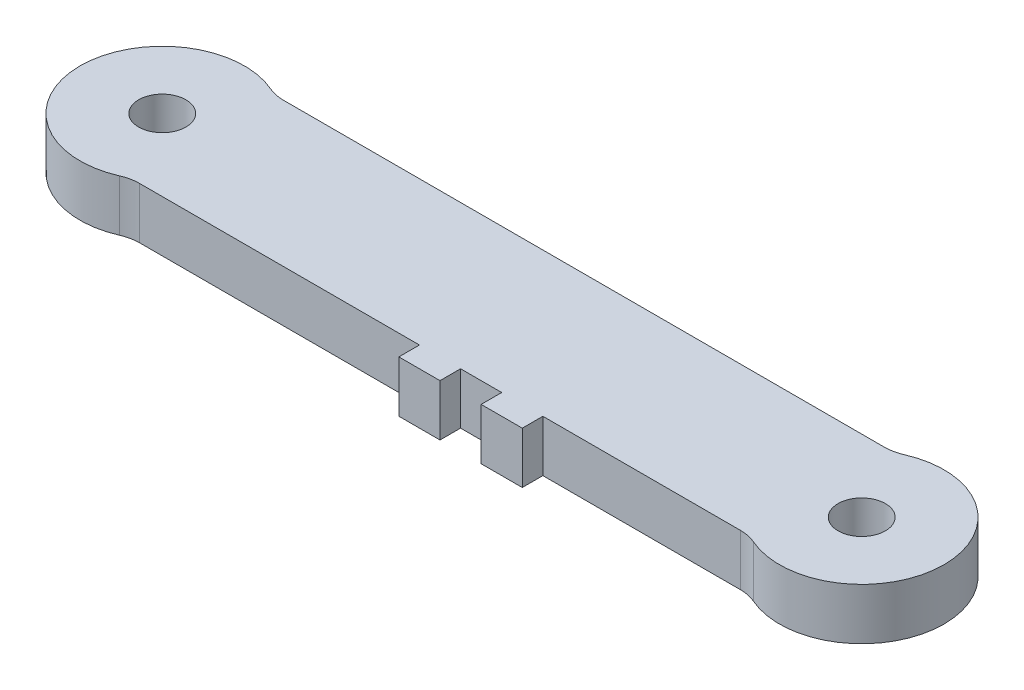
ISO-10303-21;
HEADER;
FILE_DESCRIPTION(('STEP AP214'),'2;1');
FILE_NAME('part.step','',(''),(''),'','','');
FILE_SCHEMA(('AUTOMOTIVE_DESIGN { 1 0 10303 214 1 1 1 1 }'));
ENDSEC;
DATA;
#1=APPLICATION_CONTEXT('core data for automotive mechanical design processes');
#2=APPLICATION_PROTOCOL_DEFINITION('international standard','automotive_design',2000,#1);
#3=PRODUCT_CONTEXT('',#1,'mechanical');
#4=PRODUCT('Part','Part','',(#3));
#5=PRODUCT_RELATED_PRODUCT_CATEGORY('part','',(#4));
#6=PRODUCT_DEFINITION_FORMATION('','',#4);
#7=PRODUCT_DEFINITION_CONTEXT('part definition',#1,'design');
#8=PRODUCT_DEFINITION('design','',#6,#7);
#9=PRODUCT_DEFINITION_SHAPE('','',#8);
#10=(LENGTH_UNIT() NAMED_UNIT(*) SI_UNIT(.MILLI.,.METRE.));
#11=(NAMED_UNIT(*) PLANE_ANGLE_UNIT() SI_UNIT($,.RADIAN.));
#12=(NAMED_UNIT(*) SI_UNIT($,.STERADIAN.) SOLID_ANGLE_UNIT());
#13=UNCERTAINTY_MEASURE_WITH_UNIT(LENGTH_MEASURE(1.E-05),#10,'distance_accuracy_value','');
#14=(GEOMETRIC_REPRESENTATION_CONTEXT(3) GLOBAL_UNCERTAINTY_ASSIGNED_CONTEXT((#13)) GLOBAL_UNIT_ASSIGNED_CONTEXT((#10,
#11,#12)) REPRESENTATION_CONTEXT('',''));
#15=CARTESIAN_POINT('',(0.,0.,0.));
#16=DIRECTION('',(0.,0.,1.));
#17=DIRECTION('',(1.,0.,0.));
#18=AXIS2_PLACEMENT_3D('',#15,#16,#17);
#19=CARTESIAN_POINT('',(0.,3.175,4.445));
#20=DIRECTION('',(0.,0.,-1.));
#21=DIRECTION('',(-1.,0.,0.));
#22=AXIS2_PLACEMENT_3D('',#19,#20,#21);
#23=PLANE('',#22);
#24=DIRECTION('',(0.,-1.,0.));
#25=VECTOR('',#24,1.);
#26=CARTESIAN_POINT('',(20.32,3.175,4.445));
#27=LINE('',#26,#25);
#28=CARTESIAN_POINT('',(20.32,3.175,4.445));
#29=VERTEX_POINT('',#28);
#30=CARTESIAN_POINT('',(20.32,0.,4.445));
#31=VERTEX_POINT('',#30);
#32=EDGE_CURVE('E58',#29,#31,#27,.T.);
#33=ORIENTED_EDGE('',*,*,#32,.F.);
#34=DIRECTION('',(1.,0.,0.));
#35=VECTOR('',#34,1.);
#36=CARTESIAN_POINT('',(0.,3.175,4.445));
#37=LINE('',#36,#35);
#38=CARTESIAN_POINT('',(3.04535301730358,3.175,4.445));
#39=VERTEX_POINT('',#38);
#40=EDGE_CURVE('E215',#39,#29,#37,.T.);
#41=ORIENTED_EDGE('',*,*,#40,.F.);
#42=DIRECTION('',(0.,1.,0.));
#43=VECTOR('',#42,1.);
#44=CARTESIAN_POINT('',(3.04535301730358,0.,4.445));
#45=LINE('',#44,#43);
#46=CARTESIAN_POINT('',(3.04535301730358,0.,4.445));
#47=VERTEX_POINT('',#46);
#48=EDGE_CURVE('E246',#39,#47,#45,.F.);
#49=ORIENTED_EDGE('',*,*,#48,.T.);
#50=DIRECTION('',(1.,0.,0.));
#51=VECTOR('',#50,1.);
#52=CARTESIAN_POINT('',(0.,0.,4.445));
#53=LINE('',#52,#51);
#54=EDGE_CURVE('E233',#47,#31,#53,.T.);
#55=ORIENTED_EDGE('',*,*,#54,.T.);
#56=EDGE_LOOP('',(#33,#41,#49,#55));
#57=FACE_BOUND('',#56,.T.);
#58=ADVANCED_FACE('F35',(#57),#23,.F.);
#59=DIRECTION('',(0.,1.,0.));
#60=VECTOR('',#59,1.);
#61=CARTESIAN_POINT('',(22.86,3.175,4.445));
#62=LINE('',#61,#60);
#63=CARTESIAN_POINT('',(22.86,0.,4.445));
#64=VERTEX_POINT('',#63);
#65=CARTESIAN_POINT('',(22.86,3.175,4.445));
#66=VERTEX_POINT('',#65);
#67=EDGE_CURVE('E171',#64,#66,#62,.T.);
#68=ORIENTED_EDGE('',*,*,#67,.F.);
#69=CARTESIAN_POINT('',(25.4,0.,4.445));
#70=VERTEX_POINT('',#69);
#71=EDGE_CURVE('E236',#64,#70,#53,.T.);
#72=ORIENTED_EDGE('',*,*,#71,.T.);
#73=DIRECTION('',(0.,-1.,0.));
#74=VECTOR('',#73,1.);
#75=CARTESIAN_POINT('',(25.4,3.175,4.445));
#76=LINE('',#75,#74);
#77=CARTESIAN_POINT('',(25.4,3.175,4.445));
#78=VERTEX_POINT('',#77);
#79=EDGE_CURVE('E174',#78,#70,#76,.T.);
#80=ORIENTED_EDGE('',*,*,#79,.F.);
#81=EDGE_CURVE('E50',#66,#78,#37,.T.);
#82=ORIENTED_EDGE('',*,*,#81,.F.);
#83=EDGE_LOOP('',(#68,#72,#80,#82));
#84=FACE_BOUND('',#83,.T.);
#85=ADVANCED_FACE('F285',(#84),#23,.F.);
#86=DIRECTION('',(0.,1.,0.));
#87=VECTOR('',#86,1.);
#88=CARTESIAN_POINT('',(27.94,3.175,4.445));
#89=LINE('',#88,#87);
#90=CARTESIAN_POINT('',(27.94,0.,4.445));
#91=VERTEX_POINT('',#90);
#92=CARTESIAN_POINT('',(27.94,3.175,4.445));
#93=VERTEX_POINT('',#92);
#94=EDGE_CURVE('E177',#91,#93,#89,.T.);
#95=ORIENTED_EDGE('',*,*,#94,.F.);
#96=CARTESIAN_POINT('',(40.1346469826964,0.,4.445));
#97=VERTEX_POINT('',#96);
#98=EDGE_CURVE('E232',#91,#97,#53,.T.);
#99=ORIENTED_EDGE('',*,*,#98,.T.);
#100=DIRECTION('',(0.,1.,0.));
#101=VECTOR('',#100,1.);
#102=CARTESIAN_POINT('',(40.1346469826964,3.175,4.445));
#103=LINE('',#102,#101);
#104=CARTESIAN_POINT('',(40.1346469826964,3.175,4.445));
#105=VERTEX_POINT('',#104);
#106=EDGE_CURVE('E226',#97,#105,#103,.T.);
#107=ORIENTED_EDGE('',*,*,#106,.T.);
#108=EDGE_CURVE('E214',#93,#105,#37,.T.);
#109=ORIENTED_EDGE('',*,*,#108,.F.);
#110=EDGE_LOOP('',(#95,#99,#107,#109));
#111=FACE_BOUND('',#110,.T.);
#112=ADVANCED_FACE('F284',(#111),#23,.F.);
#113=CARTESIAN_POINT('',(0.,3.175,0.));
#114=DIRECTION('',(0.,-1.,0.));
#115=DIRECTION('',(0.,0.,-1.));
#116=AXIS2_PLACEMENT_3D('',#113,#114,#115);
#117=CYLINDRICAL_SURFACE('',#116,5.08);
#118=CARTESIAN_POINT('',(0.,0.,0.));
#119=DIRECTION('',(0.,1.,0.));
#120=DIRECTION('',(0.,0.,1.));
#121=AXIS2_PLACEMENT_3D('',#118,#119,#120);
#122=CIRCLE('',#121,5.08);
#123=CARTESIAN_POINT('',(2.03023534486905,0.,-4.65666666666667));
#124=VERTEX_POINT('',#123);
#125=CARTESIAN_POINT('',(2.03023534486905,0.,4.65666666666667));
#126=VERTEX_POINT('',#125);
#127=EDGE_CURVE('E229',#124,#126,#122,.T.);
#128=ORIENTED_EDGE('',*,*,#127,.T.);
#129=DIRECTION('',(0.,-1.,0.));
#130=VECTOR('',#129,1.);
#131=CARTESIAN_POINT('',(2.03023534486905,3.175,4.65666666666667));
#132=LINE('',#131,#130);
#133=CARTESIAN_POINT('',(2.03023534486905,3.175,4.65666666666667));
#134=VERTEX_POINT('',#133);
#135=EDGE_CURVE('E252',#126,#134,#132,.F.);
#136=ORIENTED_EDGE('',*,*,#135,.T.);
#137=CARTESIAN_POINT('',(0.,3.175,0.));
#138=DIRECTION('',(0.,1.,0.));
#139=DIRECTION('',(0.,0.,1.));
#140=AXIS2_PLACEMENT_3D('',#137,#138,#139);
#141=CIRCLE('',#140,5.08);
#142=CARTESIAN_POINT('',(2.03023534486905,3.175,-4.65666666666667));
#143=VERTEX_POINT('',#142);
#144=EDGE_CURVE('E210',#143,#134,#141,.T.);
#145=ORIENTED_EDGE('',*,*,#144,.F.);
#146=DIRECTION('',(0.,-1.,0.));
#147=VECTOR('',#146,1.);
#148=CARTESIAN_POINT('',(2.03023534486905,3.175,-4.65666666666667));
#149=LINE('',#148,#147);
#150=EDGE_CURVE('E249',#143,#124,#149,.T.);
#151=ORIENTED_EDGE('',*,*,#150,.T.);
#152=EDGE_LOOP('',(#128,#136,#145,#151));
#153=FACE_BOUND('',#152,.T.);
#154=ADVANCED_FACE('F322',(#153),#117,.T.);
#155=CARTESIAN_POINT('',(43.18,3.175,0.));
#156=DIRECTION('',(0.,-1.,0.));
#157=DIRECTION('',(0.,0.,-1.));
#158=AXIS2_PLACEMENT_3D('',#155,#156,#157);
#159=CYLINDRICAL_SURFACE('',#158,5.08000000000001);
#160=CARTESIAN_POINT('',(43.18,0.,0.));
#161=DIRECTION('',(0.,1.,0.));
#162=DIRECTION('',(0.,0.,1.));
#163=AXIS2_PLACEMENT_3D('',#160,#161,#162);
#164=CIRCLE('',#163,5.08000000000001);
#165=CARTESIAN_POINT('',(41.1497646551309,0.,4.65666666666667));
#166=VERTEX_POINT('',#165);
#167=CARTESIAN_POINT('',(41.1497646551309,0.,-4.65666666666667));
#168=VERTEX_POINT('',#167);
#169=EDGE_CURVE('E235',#166,#168,#164,.T.);
#170=ORIENTED_EDGE('',*,*,#169,.T.);
#171=DIRECTION('',(0.,-1.,0.));
#172=VECTOR('',#171,1.);
#173=CARTESIAN_POINT('',(41.1497646551309,3.175,-4.65666666666667));
#174=LINE('',#173,#172);
#175=CARTESIAN_POINT('',(41.1497646551309,3.175,-4.65666666666667));
#176=VERTEX_POINT('',#175);
#177=EDGE_CURVE('E262',#168,#176,#174,.F.);
#178=ORIENTED_EDGE('',*,*,#177,.T.);
#179=CARTESIAN_POINT('',(43.18,3.175,0.));
#180=DIRECTION('',(0.,1.,0.));
#181=DIRECTION('',(0.,0.,1.));
#182=AXIS2_PLACEMENT_3D('',#179,#180,#181);
#183=CIRCLE('',#182,5.08000000000001);
#184=CARTESIAN_POINT('',(41.1497646551309,3.175,4.65666666666667));
#185=VERTEX_POINT('',#184);
#186=EDGE_CURVE('E217',#185,#176,#183,.T.);
#187=ORIENTED_EDGE('',*,*,#186,.F.);
#188=DIRECTION('',(0.,-1.,0.));
#189=VECTOR('',#188,1.);
#190=CARTESIAN_POINT('',(41.1497646551309,3.175,4.65666666666667));
#191=LINE('',#190,#189);
#192=EDGE_CURVE('E259',#185,#166,#191,.T.);
#193=ORIENTED_EDGE('',*,*,#192,.T.);
#194=EDGE_LOOP('',(#170,#178,#187,#193));
#195=FACE_BOUND('',#194,.T.);
#196=ADVANCED_FACE('F326',(#195),#159,.T.);
#197=CARTESIAN_POINT('',(0.,3.175,-4.445));
#198=DIRECTION('',(0.,0.,-1.));
#199=DIRECTION('',(-1.,0.,0.));
#200=AXIS2_PLACEMENT_3D('',#197,#198,#199);
#201=PLANE('',#200);
#202=DIRECTION('',(1.,0.,0.));
#203=VECTOR('',#202,1.);
#204=CARTESIAN_POINT('',(0.,0.,-4.445));
#205=LINE('',#204,#203);
#206=CARTESIAN_POINT('',(3.04535301730358,0.,-4.445));
#207=VERTEX_POINT('',#206);
#208=CARTESIAN_POINT('',(40.1346469826964,0.,-4.445));
#209=VERTEX_POINT('',#208);
#210=EDGE_CURVE('E239',#207,#209,#205,.T.);
#211=ORIENTED_EDGE('',*,*,#210,.F.);
#212=DIRECTION('',(0.,-1.,0.));
#213=VECTOR('',#212,1.);
#214=CARTESIAN_POINT('',(3.04535301730358,3.175,-4.445));
#215=LINE('',#214,#213);
#216=CARTESIAN_POINT('',(3.04535301730358,3.175,-4.445));
#217=VERTEX_POINT('',#216);
#218=EDGE_CURVE('E257',#207,#217,#215,.F.);
#219=ORIENTED_EDGE('',*,*,#218,.T.);
#220=DIRECTION('',(1.,0.,0.));
#221=VECTOR('',#220,1.);
#222=CARTESIAN_POINT('',(0.,3.175,-4.445));
#223=LINE('',#222,#221);
#224=CARTESIAN_POINT('',(40.1346469826964,3.175,-4.445));
#225=VERTEX_POINT('',#224);
#226=EDGE_CURVE('E220',#217,#225,#223,.T.);
#227=ORIENTED_EDGE('',*,*,#226,.T.);
#228=DIRECTION('',(0.,-1.,0.));
#229=VECTOR('',#228,1.);
#230=CARTESIAN_POINT('',(40.1346469826964,3.175,-4.445));
#231=LINE('',#230,#229);
#232=EDGE_CURVE('E254',#225,#209,#231,.T.);
#233=ORIENTED_EDGE('',*,*,#232,.T.);
#234=EDGE_LOOP('',(#211,#219,#227,#233));
#235=FACE_BOUND('',#234,.T.);
#236=ADVANCED_FACE('F331',(#235),#201,.T.);
#237=CARTESIAN_POINT('',(0.,3.175,0.));
#238=DIRECTION('',(0.,-1.,0.));
#239=DIRECTION('',(0.,0.,-1.));
#240=AXIS2_PLACEMENT_3D('',#237,#238,#239);
#241=CYLINDRICAL_SURFACE('',#240,1.4605);
#242=CARTESIAN_POINT('',(0.,3.175,0.));
#243=DIRECTION('',(0.,1.,0.));
#244=DIRECTION('',(0.,0.,1.));
#245=AXIS2_PLACEMENT_3D('',#242,#243,#244);
#246=CIRCLE('',#245,1.4605);
#247=CARTESIAN_POINT('',(0.,3.175,1.4605));
#248=VERTEX_POINT('',#247);
#249=EDGE_CURVE('E207',#248,#248,#246,.T.);
#250=ORIENTED_EDGE('',*,*,#249,.T.);
#251=EDGE_LOOP('',(#250));
#252=FACE_BOUND('',#251,.T.);
#253=CARTESIAN_POINT('',(0.,0.,0.));
#254=DIRECTION('',(0.,1.,0.));
#255=DIRECTION('',(0.,0.,1.));
#256=AXIS2_PLACEMENT_3D('',#253,#254,#255);
#257=CIRCLE('',#256,1.4605);
#258=CARTESIAN_POINT('',(0.,0.,1.4605));
#259=VERTEX_POINT('',#258);
#260=EDGE_CURVE('E206',#259,#259,#257,.T.);
#261=ORIENTED_EDGE('',*,*,#260,.F.);
#262=EDGE_LOOP('',(#261));
#263=FACE_BOUND('',#262,.T.);
#264=ADVANCED_FACE('F334',(#252,#263),#241,.F.);
#265=CARTESIAN_POINT('',(43.18,3.175,0.));
#266=DIRECTION('',(0.,-1.,0.));
#267=DIRECTION('',(0.,0.,-1.));
#268=AXIS2_PLACEMENT_3D('',#265,#266,#267);
#269=CYLINDRICAL_SURFACE('',#268,1.46050000000001);
#270=CARTESIAN_POINT('',(43.18,3.175,0.));
#271=DIRECTION('',(0.,1.,0.));
#272=DIRECTION('',(0.,0.,1.));
#273=AXIS2_PLACEMENT_3D('',#270,#271,#272);
#274=CIRCLE('',#273,1.46050000000001);
#275=CARTESIAN_POINT('',(43.18,3.175,1.46050000000001));
#276=VERTEX_POINT('',#275);
#277=EDGE_CURVE('E223',#276,#276,#274,.T.);
#278=ORIENTED_EDGE('',*,*,#277,.T.);
#279=EDGE_LOOP('',(#278));
#280=FACE_BOUND('',#279,.T.);
#281=CARTESIAN_POINT('',(43.18,0.,0.));
#282=DIRECTION('',(0.,1.,0.));
#283=DIRECTION('',(0.,0.,1.));
#284=AXIS2_PLACEMENT_3D('',#281,#282,#283);
#285=CIRCLE('',#284,1.46050000000001);
#286=CARTESIAN_POINT('',(43.18,0.,1.46050000000001));
#287=VERTEX_POINT('',#286);
#288=EDGE_CURVE('E211',#287,#287,#285,.T.);
#289=ORIENTED_EDGE('',*,*,#288,.F.);
#290=EDGE_LOOP('',(#289));
#291=FACE_BOUND('',#290,.T.);
#292=ADVANCED_FACE('F337',(#280,#291),#269,.F.);
#293=CARTESIAN_POINT('',(0.,3.175,0.));
#294=DIRECTION('',(0.,1.,0.));
#295=DIRECTION('',(0.,0.,1.));
#296=AXIS2_PLACEMENT_3D('',#293,#294,#295);
#297=PLANE('',#296);
#298=ORIENTED_EDGE('',*,*,#249,.F.);
#299=EDGE_LOOP('',(#298));
#300=FACE_BOUND('',#299,.T.);
#301=ORIENTED_EDGE('',*,*,#226,.F.);
#302=CARTESIAN_POINT('',(3.04535301730358,3.175,-6.985));
#303=DIRECTION('',(0.,1.,0.));
#304=DIRECTION('',(0.,0.,1.));
#305=AXIS2_PLACEMENT_3D('',#302,#303,#304);
#306=CIRCLE('',#305,2.54);
#307=EDGE_CURVE('E270',#217,#143,#306,.F.);
#308=ORIENTED_EDGE('',*,*,#307,.T.);
#309=ORIENTED_EDGE('',*,*,#144,.T.);
#310=CARTESIAN_POINT('',(3.04535301730358,3.175,6.985));
#311=DIRECTION('',(0.,1.,0.));
#312=DIRECTION('',(0.,0.,1.));
#313=AXIS2_PLACEMENT_3D('',#310,#311,#312);
#314=CIRCLE('',#313,2.54);
#315=EDGE_CURVE('E266',#134,#39,#314,.F.);
#316=ORIENTED_EDGE('',*,*,#315,.T.);
#317=ORIENTED_EDGE('',*,*,#40,.T.);
#318=DIRECTION('',(0.,0.,-1.));
#319=VECTOR('',#318,1.);
#320=CARTESIAN_POINT('',(20.32,3.175,5.715));
#321=LINE('',#320,#319);
#322=CARTESIAN_POINT('',(20.32,3.175,5.715));
#323=VERTEX_POINT('',#322);
#324=EDGE_CURVE('E364',#323,#29,#321,.T.);
#325=ORIENTED_EDGE('',*,*,#324,.F.);
#326=DIRECTION('',(-1.,0.,0.));
#327=VECTOR('',#326,1.);
#328=CARTESIAN_POINT('',(20.32,3.175,5.715));
#329=LINE('',#328,#327);
#330=CARTESIAN_POINT('',(22.86,3.175,5.715));
#331=VERTEX_POINT('',#330);
#332=EDGE_CURVE('E167',#331,#323,#329,.T.);
#333=ORIENTED_EDGE('',*,*,#332,.F.);
#334=DIRECTION('',(0.,0.,-1.));
#335=VECTOR('',#334,1.);
#336=CARTESIAN_POINT('',(22.86,3.175,5.715));
#337=LINE('',#336,#335);
#338=EDGE_CURVE('E179',#331,#66,#337,.T.);
#339=ORIENTED_EDGE('',*,*,#338,.T.);
#340=ORIENTED_EDGE('',*,*,#81,.T.);
#341=DIRECTION('',(0.,0.,-1.));
#342=VECTOR('',#341,1.);
#343=CARTESIAN_POINT('',(25.4,3.175,5.715));
#344=LINE('',#343,#342);
#345=CARTESIAN_POINT('',(25.4,3.175,5.715));
#346=VERTEX_POINT('',#345);
#347=EDGE_CURVE('E191',#346,#78,#344,.T.);
#348=ORIENTED_EDGE('',*,*,#347,.F.);
#349=DIRECTION('',(-1.,0.,0.));
#350=VECTOR('',#349,1.);
#351=CARTESIAN_POINT('',(25.4,3.175,5.715));
#352=LINE('',#351,#350);
#353=CARTESIAN_POINT('',(27.94,3.175,5.715));
#354=VERTEX_POINT('',#353);
#355=EDGE_CURVE('E190',#354,#346,#352,.T.);
#356=ORIENTED_EDGE('',*,*,#355,.F.);
#357=DIRECTION('',(0.,0.,-1.));
#358=VECTOR('',#357,1.);
#359=CARTESIAN_POINT('',(27.94,3.175,5.715));
#360=LINE('',#359,#358);
#361=EDGE_CURVE('E197',#354,#93,#360,.T.);
#362=ORIENTED_EDGE('',*,*,#361,.T.);
#363=ORIENTED_EDGE('',*,*,#108,.T.);
#364=CARTESIAN_POINT('',(40.1346469826964,3.175,6.985));
#365=DIRECTION('',(0.,1.,0.));
#366=DIRECTION('',(0.,0.,1.));
#367=AXIS2_PLACEMENT_3D('',#364,#365,#366);
#368=CIRCLE('',#367,2.54);
#369=EDGE_CURVE('E11',#105,#185,#368,.F.);
#370=ORIENTED_EDGE('',*,*,#369,.T.);
#371=ORIENTED_EDGE('',*,*,#186,.T.);
#372=CARTESIAN_POINT('',(40.1346469826964,3.175,-6.985));
#373=DIRECTION('',(0.,1.,0.));
#374=DIRECTION('',(0.,0.,1.));
#375=AXIS2_PLACEMENT_3D('',#372,#373,#374);
#376=CIRCLE('',#375,2.54);
#377=EDGE_CURVE('E274',#176,#225,#376,.F.);
#378=ORIENTED_EDGE('',*,*,#377,.T.);
#379=EDGE_LOOP('',(#301,#308,#309,#316,#317,#325,#333,#339,#340,#348,#356,#362,#363,#370,#371,#378));
#380=FACE_BOUND('',#379,.T.);
#381=ORIENTED_EDGE('',*,*,#277,.F.);
#382=EDGE_LOOP('',(#381));
#383=FACE_BOUND('',#382,.T.);
#384=ADVANCED_FACE('F294',(#300,#380,#383),#297,.T.);
#385=CARTESIAN_POINT('',(0.,0.,0.));
#386=DIRECTION('',(0.,1.,0.));
#387=DIRECTION('',(0.,0.,1.));
#388=AXIS2_PLACEMENT_3D('',#385,#386,#387);
#389=PLANE('',#388);
#390=ORIENTED_EDGE('',*,*,#260,.T.);
#391=EDGE_LOOP('',(#390));
#392=FACE_BOUND('',#391,.T.);
#393=ORIENTED_EDGE('',*,*,#127,.F.);
#394=CARTESIAN_POINT('',(3.04535301730358,0.,-6.985));
#395=DIRECTION('',(0.,1.,0.));
#396=DIRECTION('',(0.,0.,1.));
#397=AXIS2_PLACEMENT_3D('',#394,#395,#396);
#398=CIRCLE('',#397,2.54);
#399=EDGE_CURVE('E268',#124,#207,#398,.T.);
#400=ORIENTED_EDGE('',*,*,#399,.T.);
#401=ORIENTED_EDGE('',*,*,#210,.T.);
#402=CARTESIAN_POINT('',(40.1346469826964,0.,-6.985));
#403=DIRECTION('',(0.,1.,0.));
#404=DIRECTION('',(0.,0.,1.));
#405=AXIS2_PLACEMENT_3D('',#402,#403,#404);
#406=CIRCLE('',#405,2.54);
#407=EDGE_CURVE('E272',#209,#168,#406,.T.);
#408=ORIENTED_EDGE('',*,*,#407,.T.);
#409=ORIENTED_EDGE('',*,*,#169,.F.);
#410=CARTESIAN_POINT('',(40.1346469826964,0.,6.985));
#411=DIRECTION('',(0.,1.,0.));
#412=DIRECTION('',(0.,0.,1.));
#413=AXIS2_PLACEMENT_3D('',#410,#411,#412);
#414=CIRCLE('',#413,2.54);
#415=EDGE_CURVE('E43',#166,#97,#414,.T.);
#416=ORIENTED_EDGE('',*,*,#415,.T.);
#417=ORIENTED_EDGE('',*,*,#98,.F.);
#418=DIRECTION('',(0.,0.,-1.));
#419=VECTOR('',#418,1.);
#420=CARTESIAN_POINT('',(27.94,0.,5.715));
#421=LINE('',#420,#419);
#422=CARTESIAN_POINT('',(27.94,0.,5.715));
#423=VERTEX_POINT('',#422);
#424=EDGE_CURVE('E200',#423,#91,#421,.T.);
#425=ORIENTED_EDGE('',*,*,#424,.F.);
#426=DIRECTION('',(1.,0.,0.));
#427=VECTOR('',#426,1.);
#428=CARTESIAN_POINT('',(25.4,0.,5.715));
#429=LINE('',#428,#427);
#430=CARTESIAN_POINT('',(25.4,0.,5.715));
#431=VERTEX_POINT('',#430);
#432=EDGE_CURVE('E186',#431,#423,#429,.T.);
#433=ORIENTED_EDGE('',*,*,#432,.F.);
#434=DIRECTION('',(0.,0.,-1.));
#435=VECTOR('',#434,1.);
#436=CARTESIAN_POINT('',(25.4,0.,5.715));
#437=LINE('',#436,#435);
#438=EDGE_CURVE('E203',#431,#70,#437,.T.);
#439=ORIENTED_EDGE('',*,*,#438,.T.);
#440=ORIENTED_EDGE('',*,*,#71,.F.);
#441=DIRECTION('',(0.,0.,-1.));
#442=VECTOR('',#441,1.);
#443=CARTESIAN_POINT('',(22.86,0.,5.715));
#444=LINE('',#443,#442);
#445=CARTESIAN_POINT('',(22.86,0.,5.715));
#446=VERTEX_POINT('',#445);
#447=EDGE_CURVE('E158',#446,#64,#444,.T.);
#448=ORIENTED_EDGE('',*,*,#447,.F.);
#449=DIRECTION('',(1.,0.,0.));
#450=VECTOR('',#449,1.);
#451=CARTESIAN_POINT('',(20.32,0.,5.715));
#452=LINE('',#451,#450);
#453=CARTESIAN_POINT('',(20.32,0.,5.715));
#454=VERTEX_POINT('',#453);
#455=EDGE_CURVE('E149',#454,#446,#452,.T.);
#456=ORIENTED_EDGE('',*,*,#455,.F.);
#457=DIRECTION('',(0.,0.,-1.));
#458=VECTOR('',#457,1.);
#459=CARTESIAN_POINT('',(20.32,0.,5.715));
#460=LINE('',#459,#458);
#461=EDGE_CURVE('E156',#454,#31,#460,.T.);
#462=ORIENTED_EDGE('',*,*,#461,.T.);
#463=ORIENTED_EDGE('',*,*,#54,.F.);
#464=CARTESIAN_POINT('',(3.04535301730358,0.,6.985));
#465=DIRECTION('',(0.,1.,0.));
#466=DIRECTION('',(0.,0.,1.));
#467=AXIS2_PLACEMENT_3D('',#464,#465,#466);
#468=CIRCLE('',#467,2.54);
#469=EDGE_CURVE('E264',#47,#126,#468,.T.);
#470=ORIENTED_EDGE('',*,*,#469,.T.);
#471=EDGE_LOOP('',(#393,#400,#401,#408,#409,#416,#417,#425,#433,#439,#440,#448,#456,#462,#463,#470));
#472=FACE_BOUND('',#471,.T.);
#473=ORIENTED_EDGE('',*,*,#288,.T.);
#474=EDGE_LOOP('',(#473));
#475=FACE_BOUND('',#474,.T.);
#476=ADVANCED_FACE('F152',(#392,#472,#475),#389,.F.);
#477=CARTESIAN_POINT('',(3.04535301730358,3.175,6.985));
#478=DIRECTION('',(0.,-1.,0.));
#479=DIRECTION('',(0.,0.,-1.));
#480=AXIS2_PLACEMENT_3D('',#477,#478,#479);
#481=CYLINDRICAL_SURFACE('',#480,2.54);
#482=ORIENTED_EDGE('',*,*,#315,.F.);
#483=ORIENTED_EDGE('',*,*,#135,.F.);
#484=ORIENTED_EDGE('',*,*,#469,.F.);
#485=ORIENTED_EDGE('',*,*,#48,.F.);
#486=EDGE_LOOP('',(#482,#483,#484,#485));
#487=FACE_BOUND('',#486,.T.);
#488=ADVANCED_FACE('F339',(#487),#481,.F.);
#489=CARTESIAN_POINT('',(3.04535301730358,3.175,-6.985));
#490=DIRECTION('',(0.,-1.,0.));
#491=DIRECTION('',(0.,0.,-1.));
#492=AXIS2_PLACEMENT_3D('',#489,#490,#491);
#493=CYLINDRICAL_SURFACE('',#492,2.54);
#494=ORIENTED_EDGE('',*,*,#307,.F.);
#495=ORIENTED_EDGE('',*,*,#218,.F.);
#496=ORIENTED_EDGE('',*,*,#399,.F.);
#497=ORIENTED_EDGE('',*,*,#150,.F.);
#498=EDGE_LOOP('',(#494,#495,#496,#497));
#499=FACE_BOUND('',#498,.T.);
#500=ADVANCED_FACE('F342',(#499),#493,.F.);
#501=CARTESIAN_POINT('',(40.1346469826964,3.175,-6.985));
#502=DIRECTION('',(0.,-1.,0.));
#503=DIRECTION('',(0.,0.,-1.));
#504=AXIS2_PLACEMENT_3D('',#501,#502,#503);
#505=CYLINDRICAL_SURFACE('',#504,2.54);
#506=ORIENTED_EDGE('',*,*,#377,.F.);
#507=ORIENTED_EDGE('',*,*,#177,.F.);
#508=ORIENTED_EDGE('',*,*,#407,.F.);
#509=ORIENTED_EDGE('',*,*,#232,.F.);
#510=EDGE_LOOP('',(#506,#507,#508,#509));
#511=FACE_BOUND('',#510,.T.);
#512=ADVANCED_FACE('F345',(#511),#505,.F.);
#513=CARTESIAN_POINT('',(40.1346469826964,3.175,6.985));
#514=DIRECTION('',(0.,-1.,0.));
#515=DIRECTION('',(0.,0.,-1.));
#516=AXIS2_PLACEMENT_3D('',#513,#514,#515);
#517=CYLINDRICAL_SURFACE('',#516,2.54);
#518=ORIENTED_EDGE('',*,*,#369,.F.);
#519=ORIENTED_EDGE('',*,*,#106,.F.);
#520=ORIENTED_EDGE('',*,*,#415,.F.);
#521=ORIENTED_EDGE('',*,*,#192,.F.);
#522=EDGE_LOOP('',(#518,#519,#520,#521));
#523=FACE_BOUND('',#522,.T.);
#524=ADVANCED_FACE('F37',(#523),#517,.F.);
#525=CARTESIAN_POINT('',(25.4,3.175,5.715));
#526=DIRECTION('',(1.,0.,0.));
#527=DIRECTION('',(0.,0.,-1.));
#528=AXIS2_PLACEMENT_3D('',#525,#526,#527);
#529=PLANE('',#528);
#530=ORIENTED_EDGE('',*,*,#79,.T.);
#531=ORIENTED_EDGE('',*,*,#438,.F.);
#532=DIRECTION('',(0.,-1.,0.));
#533=VECTOR('',#532,1.);
#534=CARTESIAN_POINT('',(25.4,3.175,5.715));
#535=LINE('',#534,#533);
#536=EDGE_CURVE('E183',#346,#431,#535,.T.);
#537=ORIENTED_EDGE('',*,*,#536,.F.);
#538=ORIENTED_EDGE('',*,*,#347,.T.);
#539=EDGE_LOOP('',(#530,#531,#537,#538));
#540=FACE_BOUND('',#539,.T.);
#541=ADVANCED_FACE('F289',(#540),#529,.F.);
#542=CARTESIAN_POINT('',(27.94,3.175,5.715));
#543=DIRECTION('',(-1.,0.,0.));
#544=DIRECTION('',(0.,0.,1.));
#545=AXIS2_PLACEMENT_3D('',#542,#543,#544);
#546=PLANE('',#545);
#547=ORIENTED_EDGE('',*,*,#94,.T.);
#548=ORIENTED_EDGE('',*,*,#361,.F.);
#549=DIRECTION('',(0.,1.,0.));
#550=VECTOR('',#549,1.);
#551=CARTESIAN_POINT('',(27.94,3.175,5.715));
#552=LINE('',#551,#550);
#553=EDGE_CURVE('E188',#423,#354,#552,.T.);
#554=ORIENTED_EDGE('',*,*,#553,.F.);
#555=ORIENTED_EDGE('',*,*,#424,.T.);
#556=EDGE_LOOP('',(#547,#548,#554,#555));
#557=FACE_BOUND('',#556,.T.);
#558=ADVANCED_FACE('F302',(#557),#546,.F.);
#559=CARTESIAN_POINT('',(0.,0.,5.715));
#560=DIRECTION('',(0.,0.,1.));
#561=DIRECTION('',(1.,0.,0.));
#562=AXIS2_PLACEMENT_3D('',#559,#560,#561);
#563=PLANE('',#562);
#564=ORIENTED_EDGE('',*,*,#536,.T.);
#565=ORIENTED_EDGE('',*,*,#432,.T.);
#566=ORIENTED_EDGE('',*,*,#553,.T.);
#567=ORIENTED_EDGE('',*,*,#355,.T.);
#568=EDGE_LOOP('',(#564,#565,#566,#567));
#569=FACE_BOUND('',#568,.T.);
#570=ADVANCED_FACE('F304',(#569),#563,.T.);
#571=CARTESIAN_POINT('',(20.32,3.175,5.715));
#572=DIRECTION('',(1.,0.,0.));
#573=DIRECTION('',(0.,0.,-1.));
#574=AXIS2_PLACEMENT_3D('',#571,#572,#573);
#575=PLANE('',#574);
#576=ORIENTED_EDGE('',*,*,#32,.T.);
#577=ORIENTED_EDGE('',*,*,#461,.F.);
#578=DIRECTION('',(0.,-1.,0.));
#579=VECTOR('',#578,1.);
#580=CARTESIAN_POINT('',(20.32,3.175,5.715));
#581=LINE('',#580,#579);
#582=EDGE_CURVE('E162',#323,#454,#581,.T.);
#583=ORIENTED_EDGE('',*,*,#582,.F.);
#584=ORIENTED_EDGE('',*,*,#324,.T.);
#585=EDGE_LOOP('',(#576,#577,#583,#584));
#586=FACE_BOUND('',#585,.T.);
#587=ADVANCED_FACE('F173',(#586),#575,.F.);
#588=CARTESIAN_POINT('',(22.86,3.175,5.715));
#589=DIRECTION('',(-1.,0.,0.));
#590=DIRECTION('',(0.,0.,1.));
#591=AXIS2_PLACEMENT_3D('',#588,#589,#590);
#592=PLANE('',#591);
#593=ORIENTED_EDGE('',*,*,#67,.T.);
#594=ORIENTED_EDGE('',*,*,#338,.F.);
#595=DIRECTION('',(0.,1.,0.));
#596=VECTOR('',#595,1.);
#597=CARTESIAN_POINT('',(22.86,3.175,5.715));
#598=LINE('',#597,#596);
#599=EDGE_CURVE('E161',#446,#331,#598,.T.);
#600=ORIENTED_EDGE('',*,*,#599,.F.);
#601=ORIENTED_EDGE('',*,*,#447,.T.);
#602=EDGE_LOOP('',(#593,#594,#600,#601));
#603=FACE_BOUND('',#602,.T.);
#604=ADVANCED_FACE('F311',(#603),#592,.F.);
#605=CARTESIAN_POINT('',(0.,0.,5.715));
#606=DIRECTION('',(0.,0.,1.));
#607=DIRECTION('',(1.,0.,0.));
#608=AXIS2_PLACEMENT_3D('',#605,#606,#607);
#609=PLANE('',#608);
#610=ORIENTED_EDGE('',*,*,#582,.T.);
#611=ORIENTED_EDGE('',*,*,#455,.T.);
#612=ORIENTED_EDGE('',*,*,#599,.T.);
#613=ORIENTED_EDGE('',*,*,#332,.T.);
#614=EDGE_LOOP('',(#610,#611,#612,#613));
#615=FACE_BOUND('',#614,.T.);
#616=ADVANCED_FACE('F165',(#615),#609,.T.);
#617=CLOSED_SHELL('',(#58,#85,#112,#154,#196,#236,#264,#292,#384,#476,#488,#500,#512,#524,#541,
#558,#570,#587,#604,#616));
#618=MANIFOLD_SOLID_BREP('B2',#617);
#619=ADVANCED_BREP_SHAPE_REPRESENTATION('',(#18,#618),#14);
#620=SHAPE_DEFINITION_REPRESENTATION(#9,#619);
ENDSEC;
END-ISO-10303-21;
